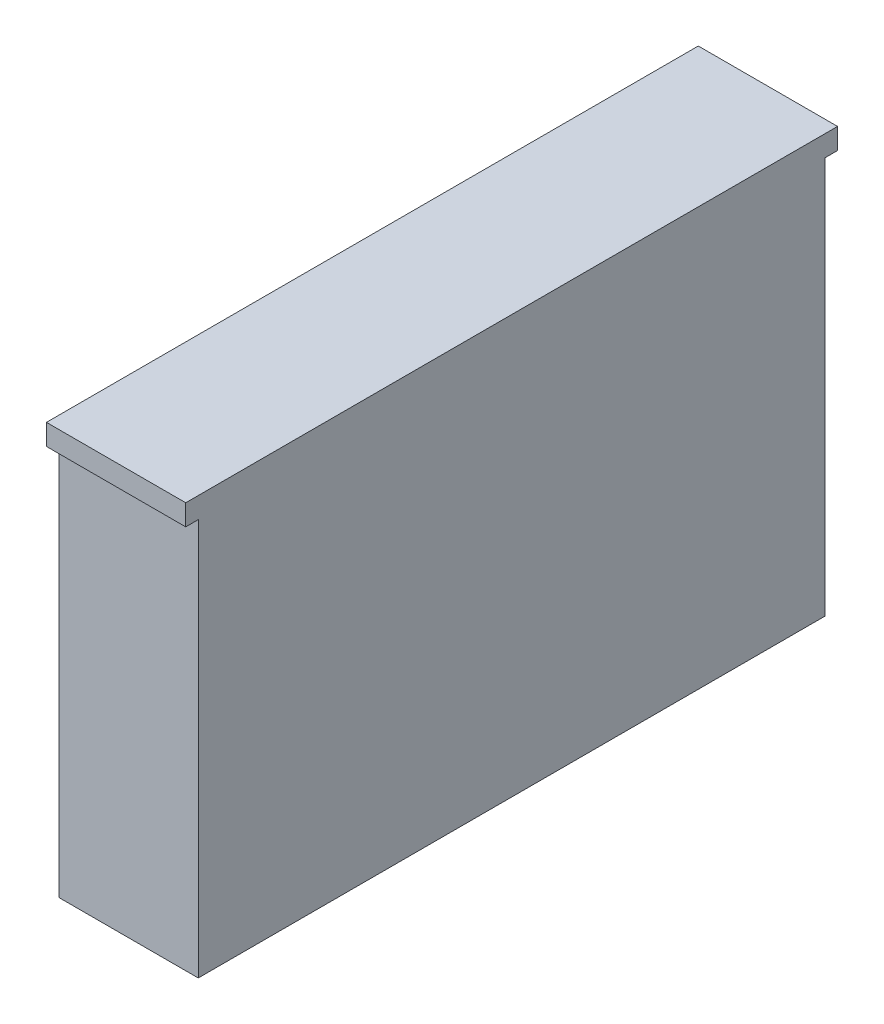
ISO-10303-21;
HEADER;
FILE_DESCRIPTION(('STEP AP214'),'2;1');
FILE_NAME('part.step','',(''),(''),'','','');
FILE_SCHEMA(('AUTOMOTIVE_DESIGN { 1 0 10303 214 1 1 1 1 }'));
ENDSEC;
DATA;
#1=APPLICATION_CONTEXT('core data for automotive mechanical design processes');
#2=APPLICATION_PROTOCOL_DEFINITION('international standard','automotive_design',2000,#1);
#3=PRODUCT_CONTEXT('',#1,'mechanical');
#4=PRODUCT('Part','Part','',(#3));
#5=PRODUCT_RELATED_PRODUCT_CATEGORY('part','',(#4));
#6=PRODUCT_DEFINITION_FORMATION('','',#4);
#7=PRODUCT_DEFINITION_CONTEXT('part definition',#1,'design');
#8=PRODUCT_DEFINITION('design','',#6,#7);
#9=PRODUCT_DEFINITION_SHAPE('','',#8);
#10=(LENGTH_UNIT() NAMED_UNIT(*) SI_UNIT(.MILLI.,.METRE.));
#11=(NAMED_UNIT(*) PLANE_ANGLE_UNIT() SI_UNIT($,.RADIAN.));
#12=(NAMED_UNIT(*) SI_UNIT($,.STERADIAN.) SOLID_ANGLE_UNIT());
#13=UNCERTAINTY_MEASURE_WITH_UNIT(LENGTH_MEASURE(1.E-05),#10,'distance_accuracy_value','');
#14=(GEOMETRIC_REPRESENTATION_CONTEXT(3) GLOBAL_UNCERTAINTY_ASSIGNED_CONTEXT((#13)) GLOBAL_UNIT_ASSIGNED_CONTEXT((#10,
#11,#12)) REPRESENTATION_CONTEXT('',''));
#15=CARTESIAN_POINT('',(0.,0.,0.));
#16=DIRECTION('',(0.,0.,1.));
#17=DIRECTION('',(1.,0.,0.));
#18=AXIS2_PLACEMENT_3D('',#15,#16,#17);
#19=CARTESIAN_POINT('',(100.,-150.,225.));
#20=DIRECTION('',(0.,0.,-1.));
#21=DIRECTION('',(-1.,0.,0.));
#22=AXIS2_PLACEMENT_3D('',#19,#20,#21);
#23=PLANE('',#22);
#24=DIRECTION('',(1.,0.,0.));
#25=VECTOR('',#24,1.);
#26=CARTESIAN_POINT('',(100.,135.,225.));
#27=LINE('',#26,#25);
#28=CARTESIAN_POINT('',(0.,135.,225.));
#29=VERTEX_POINT('',#28);
#30=CARTESIAN_POINT('',(100.,135.,225.));
#31=VERTEX_POINT('',#30);
#32=EDGE_CURVE('E54',#29,#31,#27,.T.);
#33=ORIENTED_EDGE('',*,*,#32,.F.);
#34=DIRECTION('',(0.,-1.,0.));
#35=VECTOR('',#34,1.);
#36=CARTESIAN_POINT('',(0.,-150.,225.));
#37=LINE('',#36,#35);
#38=CARTESIAN_POINT('',(0.,-150.,225.));
#39=VERTEX_POINT('',#38);
#40=EDGE_CURVE('E129',#29,#39,#37,.T.);
#41=ORIENTED_EDGE('',*,*,#40,.T.);
#42=DIRECTION('',(-1.,0.,0.));
#43=VECTOR('',#42,1.);
#44=CARTESIAN_POINT('',(100.,-150.,225.));
#45=LINE('',#44,#43);
#46=CARTESIAN_POINT('',(100.,-150.,225.));
#47=VERTEX_POINT('',#46);
#48=EDGE_CURVE('E11',#47,#39,#45,.T.);
#49=ORIENTED_EDGE('',*,*,#48,.F.);
#50=DIRECTION('',(0.,-1.,0.));
#51=VECTOR('',#50,1.);
#52=CARTESIAN_POINT('',(100.,-150.,225.));
#53=LINE('',#52,#51);
#54=EDGE_CURVE('E161',#31,#47,#53,.T.);
#55=ORIENTED_EDGE('',*,*,#54,.F.);
#56=EDGE_LOOP('',(#33,#41,#49,#55));
#57=FACE_BOUND('',#56,.T.);
#58=ADVANCED_FACE('F39',(#57),#23,.F.);
#59=CARTESIAN_POINT('',(100.,-150.,-225.));
#60=DIRECTION('',(0.,0.,1.));
#61=DIRECTION('',(1.,0.,0.));
#62=AXIS2_PLACEMENT_3D('',#59,#60,#61);
#63=PLANE('',#62);
#64=DIRECTION('',(-1.,0.,0.));
#65=VECTOR('',#64,1.);
#66=CARTESIAN_POINT('',(0.,135.,-225.));
#67=LINE('',#66,#65);
#68=CARTESIAN_POINT('',(100.,135.,-225.));
#69=VERTEX_POINT('',#68);
#70=CARTESIAN_POINT('',(0.,135.,-225.));
#71=VERTEX_POINT('',#70);
#72=EDGE_CURVE('E62',#69,#71,#67,.T.);
#73=ORIENTED_EDGE('',*,*,#72,.F.);
#74=DIRECTION('',(0.,1.,0.));
#75=VECTOR('',#74,1.);
#76=CARTESIAN_POINT('',(100.,-150.,-225.));
#77=LINE('',#76,#75);
#78=CARTESIAN_POINT('',(100.,-150.,-225.));
#79=VERTEX_POINT('',#78);
#80=EDGE_CURVE('E168',#79,#69,#77,.T.);
#81=ORIENTED_EDGE('',*,*,#80,.F.);
#82=DIRECTION('',(-1.,0.,0.));
#83=VECTOR('',#82,1.);
#84=CARTESIAN_POINT('',(100.,-150.,-225.));
#85=LINE('',#84,#83);
#86=CARTESIAN_POINT('',(0.,-150.,-225.));
#87=VERTEX_POINT('',#86);
#88=EDGE_CURVE('E47',#79,#87,#85,.T.);
#89=ORIENTED_EDGE('',*,*,#88,.T.);
#90=DIRECTION('',(0.,1.,0.));
#91=VECTOR('',#90,1.);
#92=CARTESIAN_POINT('',(0.,-150.,-225.));
#93=LINE('',#92,#91);
#94=EDGE_CURVE('E179',#87,#71,#93,.T.);
#95=ORIENTED_EDGE('',*,*,#94,.T.);
#96=EDGE_LOOP('',(#73,#81,#89,#95));
#97=FACE_BOUND('',#96,.T.);
#98=ADVANCED_FACE('F187',(#97),#63,.F.);
#99=CARTESIAN_POINT('',(100.,-150.,-225.));
#100=DIRECTION('',(0.,1.,0.));
#101=DIRECTION('',(0.,0.,1.));
#102=AXIS2_PLACEMENT_3D('',#99,#100,#101);
#103=PLANE('',#102);
#104=DIRECTION('',(0.,0.,-1.));
#105=VECTOR('',#104,1.);
#106=CARTESIAN_POINT('',(0.,-150.,-225.));
#107=LINE('',#106,#105);
#108=EDGE_CURVE('E176',#39,#87,#107,.T.);
#109=ORIENTED_EDGE('',*,*,#108,.T.);
#110=ORIENTED_EDGE('',*,*,#88,.F.);
#111=DIRECTION('',(0.,0.,-1.));
#112=VECTOR('',#111,1.);
#113=CARTESIAN_POINT('',(100.,-150.,-225.));
#114=LINE('',#113,#112);
#115=EDGE_CURVE('E164',#47,#79,#114,.T.);
#116=ORIENTED_EDGE('',*,*,#115,.F.);
#117=ORIENTED_EDGE('',*,*,#48,.T.);
#118=EDGE_LOOP('',(#109,#110,#116,#117));
#119=FACE_BOUND('',#118,.T.);
#120=ADVANCED_FACE('F199',(#119),#103,.F.);
#121=CARTESIAN_POINT('',(100.,150.,-225.));
#122=DIRECTION('',(0.,-1.,0.));
#123=DIRECTION('',(0.,0.,-1.));
#124=AXIS2_PLACEMENT_3D('',#121,#122,#123);
#125=PLANE('',#124);
#126=DIRECTION('',(0.,0.,1.));
#127=VECTOR('',#126,1.);
#128=CARTESIAN_POINT('',(0.,150.,-225.));
#129=LINE('',#128,#127);
#130=CARTESIAN_POINT('',(0.,150.,-234.));
#131=VERTEX_POINT('',#130);
#132=CARTESIAN_POINT('',(0.,150.,234.));
#133=VERTEX_POINT('',#132);
#134=EDGE_CURVE('E165',#131,#133,#129,.T.);
#135=ORIENTED_EDGE('',*,*,#134,.T.);
#136=DIRECTION('',(-1.,0.,0.));
#137=VECTOR('',#136,1.);
#138=CARTESIAN_POINT('',(0.,150.,234.));
#139=LINE('',#138,#137);
#140=CARTESIAN_POINT('',(100.,150.,234.));
#141=VERTEX_POINT('',#140);
#142=EDGE_CURVE('E123',#141,#133,#139,.T.);
#143=ORIENTED_EDGE('',*,*,#142,.F.);
#144=DIRECTION('',(0.,0.,1.));
#145=VECTOR('',#144,1.);
#146=CARTESIAN_POINT('',(100.,150.,-225.));
#147=LINE('',#146,#145);
#148=CARTESIAN_POINT('',(100.,150.,-234.));
#149=VERTEX_POINT('',#148);
#150=EDGE_CURVE('E171',#149,#141,#147,.T.);
#151=ORIENTED_EDGE('',*,*,#150,.F.);
#152=DIRECTION('',(1.,0.,0.));
#153=VECTOR('',#152,1.);
#154=CARTESIAN_POINT('',(100.,150.,-234.));
#155=LINE('',#154,#153);
#156=EDGE_CURVE('E149',#131,#149,#155,.T.);
#157=ORIENTED_EDGE('',*,*,#156,.F.);
#158=EDGE_LOOP('',(#135,#143,#151,#157));
#159=FACE_BOUND('',#158,.T.);
#160=ADVANCED_FACE('F206',(#159),#125,.F.);
#161=CARTESIAN_POINT('',(100.,0.,0.));
#162=DIRECTION('',(1.,0.,0.));
#163=DIRECTION('',(0.,0.,-1.));
#164=AXIS2_PLACEMENT_3D('',#161,#162,#163);
#165=PLANE('',#164);
#166=ORIENTED_EDGE('',*,*,#150,.T.);
#167=DIRECTION('',(0.,1.,0.));
#168=VECTOR('',#167,1.);
#169=CARTESIAN_POINT('',(100.,150.,234.));
#170=LINE('',#169,#168);
#171=CARTESIAN_POINT('',(100.,135.,234.));
#172=VERTEX_POINT('',#171);
#173=EDGE_CURVE('E116',#172,#141,#170,.T.);
#174=ORIENTED_EDGE('',*,*,#173,.F.);
#175=DIRECTION('',(0.,0.,-1.));
#176=VECTOR('',#175,1.);
#177=CARTESIAN_POINT('',(100.,135.,234.));
#178=LINE('',#177,#176);
#179=EDGE_CURVE('E111',#172,#31,#178,.T.);
#180=ORIENTED_EDGE('',*,*,#179,.T.);
#181=ORIENTED_EDGE('',*,*,#54,.T.);
#182=ORIENTED_EDGE('',*,*,#115,.T.);
#183=ORIENTED_EDGE('',*,*,#80,.T.);
#184=DIRECTION('',(0.,0.,1.));
#185=VECTOR('',#184,1.);
#186=CARTESIAN_POINT('',(100.,135.,-234.));
#187=LINE('',#186,#185);
#188=CARTESIAN_POINT('',(100.,135.,-234.));
#189=VERTEX_POINT('',#188);
#190=EDGE_CURVE('E157',#189,#69,#187,.T.);
#191=ORIENTED_EDGE('',*,*,#190,.F.);
#192=DIRECTION('',(0.,-1.,0.));
#193=VECTOR('',#192,1.);
#194=CARTESIAN_POINT('',(100.,135.,-234.));
#195=LINE('',#194,#193);
#196=EDGE_CURVE('E134',#149,#189,#195,.T.);
#197=ORIENTED_EDGE('',*,*,#196,.F.);
#198=EDGE_LOOP('',(#166,#174,#180,#181,#182,#183,#191,#197));
#199=FACE_BOUND('',#198,.T.);
#200=ADVANCED_FACE('F197',(#199),#165,.T.);
#201=CARTESIAN_POINT('',(0.,0.,0.));
#202=DIRECTION('',(1.,0.,0.));
#203=DIRECTION('',(0.,0.,-1.));
#204=AXIS2_PLACEMENT_3D('',#201,#202,#203);
#205=PLANE('',#204);
#206=ORIENTED_EDGE('',*,*,#40,.F.);
#207=DIRECTION('',(0.,0.,-1.));
#208=VECTOR('',#207,1.);
#209=CARTESIAN_POINT('',(0.,135.,234.));
#210=LINE('',#209,#208);
#211=CARTESIAN_POINT('',(0.,135.,234.));
#212=VERTEX_POINT('',#211);
#213=EDGE_CURVE('E109',#212,#29,#210,.T.);
#214=ORIENTED_EDGE('',*,*,#213,.F.);
#215=DIRECTION('',(0.,-1.,0.));
#216=VECTOR('',#215,1.);
#217=CARTESIAN_POINT('',(0.,135.,234.));
#218=LINE('',#217,#216);
#219=EDGE_CURVE('E117',#133,#212,#218,.T.);
#220=ORIENTED_EDGE('',*,*,#219,.F.);
#221=ORIENTED_EDGE('',*,*,#134,.F.);
#222=DIRECTION('',(0.,1.,0.));
#223=VECTOR('',#222,1.);
#224=CARTESIAN_POINT('',(0.,150.,-234.));
#225=LINE('',#224,#223);
#226=CARTESIAN_POINT('',(0.,135.,-234.));
#227=VERTEX_POINT('',#226);
#228=EDGE_CURVE('E145',#227,#131,#225,.T.);
#229=ORIENTED_EDGE('',*,*,#228,.F.);
#230=DIRECTION('',(0.,0.,1.));
#231=VECTOR('',#230,1.);
#232=CARTESIAN_POINT('',(0.,135.,-234.));
#233=LINE('',#232,#231);
#234=EDGE_CURVE('E152',#227,#71,#233,.T.);
#235=ORIENTED_EDGE('',*,*,#234,.T.);
#236=ORIENTED_EDGE('',*,*,#94,.F.);
#237=ORIENTED_EDGE('',*,*,#108,.F.);
#238=EDGE_LOOP('',(#206,#214,#220,#221,#229,#235,#236,#237));
#239=FACE_BOUND('',#238,.T.);
#240=ADVANCED_FACE('F127',(#239),#205,.F.);
#241=CARTESIAN_POINT('',(0.,135.,-234.));
#242=DIRECTION('',(0.,1.,0.));
#243=DIRECTION('',(0.,0.,1.));
#244=AXIS2_PLACEMENT_3D('',#241,#242,#243);
#245=PLANE('',#244);
#246=ORIENTED_EDGE('',*,*,#72,.T.);
#247=ORIENTED_EDGE('',*,*,#234,.F.);
#248=DIRECTION('',(-1.,0.,0.));
#249=VECTOR('',#248,1.);
#250=CARTESIAN_POINT('',(0.,135.,-234.));
#251=LINE('',#250,#249);
#252=EDGE_CURVE('E142',#189,#227,#251,.T.);
#253=ORIENTED_EDGE('',*,*,#252,.F.);
#254=ORIENTED_EDGE('',*,*,#190,.T.);
#255=EDGE_LOOP('',(#246,#247,#253,#254));
#256=FACE_BOUND('',#255,.T.);
#257=ADVANCED_FACE('F193',(#256),#245,.F.);
#258=CARTESIAN_POINT('',(0.,0.,-234.));
#259=DIRECTION('',(0.,0.,1.));
#260=DIRECTION('',(1.,0.,0.));
#261=AXIS2_PLACEMENT_3D('',#258,#259,#260);
#262=PLANE('',#261);
#263=ORIENTED_EDGE('',*,*,#196,.T.);
#264=ORIENTED_EDGE('',*,*,#252,.T.);
#265=ORIENTED_EDGE('',*,*,#228,.T.);
#266=ORIENTED_EDGE('',*,*,#156,.T.);
#267=EDGE_LOOP('',(#263,#264,#265,#266));
#268=FACE_BOUND('',#267,.T.);
#269=ADVANCED_FACE('F209',(#268),#262,.F.);
#270=CARTESIAN_POINT('',(100.,135.,234.));
#271=DIRECTION('',(0.,1.,0.));
#272=DIRECTION('',(0.,0.,1.));
#273=AXIS2_PLACEMENT_3D('',#270,#271,#272);
#274=PLANE('',#273);
#275=ORIENTED_EDGE('',*,*,#32,.T.);
#276=ORIENTED_EDGE('',*,*,#179,.F.);
#277=DIRECTION('',(1.,0.,0.));
#278=VECTOR('',#277,1.);
#279=CARTESIAN_POINT('',(100.,135.,234.));
#280=LINE('',#279,#278);
#281=EDGE_CURVE('E105',#212,#172,#280,.T.);
#282=ORIENTED_EDGE('',*,*,#281,.F.);
#283=ORIENTED_EDGE('',*,*,#213,.T.);
#284=EDGE_LOOP('',(#275,#276,#282,#283));
#285=FACE_BOUND('',#284,.T.);
#286=ADVANCED_FACE('F107',(#285),#274,.F.);
#287=CARTESIAN_POINT('',(0.,0.,234.));
#288=DIRECTION('',(0.,0.,-1.));
#289=DIRECTION('',(-1.,0.,0.));
#290=AXIS2_PLACEMENT_3D('',#287,#288,#289);
#291=PLANE('',#290);
#292=ORIENTED_EDGE('',*,*,#219,.T.);
#293=ORIENTED_EDGE('',*,*,#281,.T.);
#294=ORIENTED_EDGE('',*,*,#173,.T.);
#295=ORIENTED_EDGE('',*,*,#142,.T.);
#296=EDGE_LOOP('',(#292,#293,#294,#295));
#297=FACE_BOUND('',#296,.T.);
#298=ADVANCED_FACE('F121',(#297),#291,.F.);
#299=CLOSED_SHELL('',(#58,#98,#120,#160,#200,#240,#257,#269,#286,#298));
#300=MANIFOLD_SOLID_BREP('B2',#299);
#301=ADVANCED_BREP_SHAPE_REPRESENTATION('',(#18,#300),#14);
#302=SHAPE_DEFINITION_REPRESENTATION(#9,#301);
ENDSEC;
END-ISO-10303-21;
